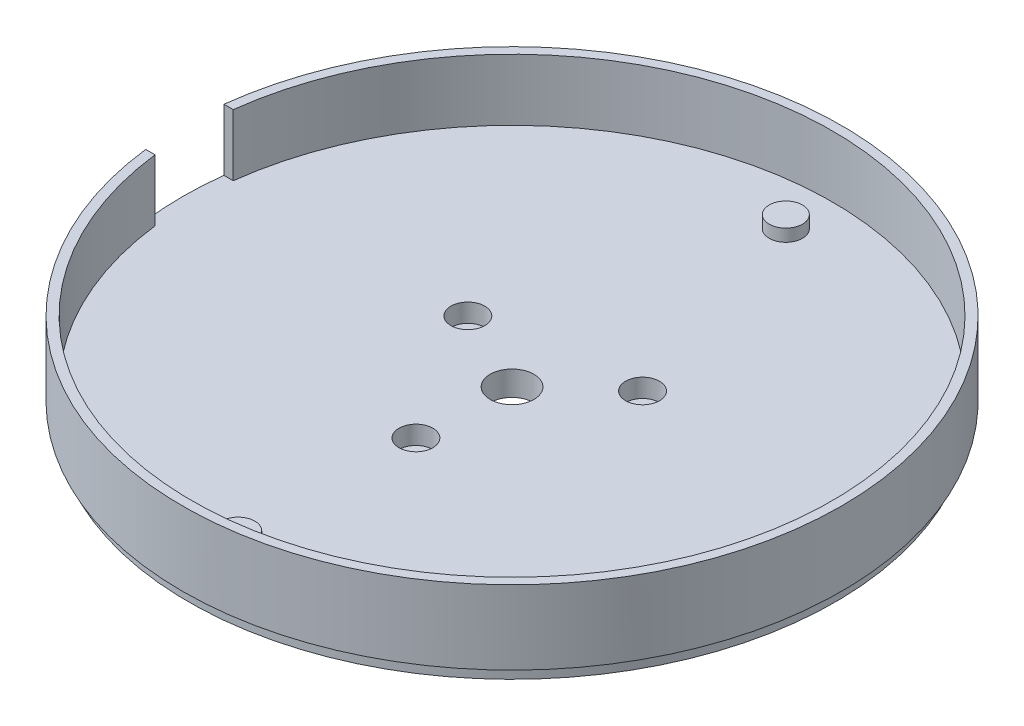
ISO-10303-21;
HEADER;
FILE_DESCRIPTION(('STEP AP214'),'2;1');
FILE_NAME('part.step','',(''),(''),'','','');
FILE_SCHEMA(('AUTOMOTIVE_DESIGN { 1 0 10303 214 1 1 1 1 }'));
ENDSEC;
DATA;
#1=APPLICATION_CONTEXT('core data for automotive mechanical design processes');
#2=APPLICATION_PROTOCOL_DEFINITION('international standard','automotive_design',2000,#1);
#3=PRODUCT_CONTEXT('',#1,'mechanical');
#4=PRODUCT('Part','Part','',(#3));
#5=PRODUCT_RELATED_PRODUCT_CATEGORY('part','',(#4));
#6=PRODUCT_DEFINITION_FORMATION('','',#4);
#7=PRODUCT_DEFINITION_CONTEXT('part definition',#1,'design');
#8=PRODUCT_DEFINITION('design','',#6,#7);
#9=PRODUCT_DEFINITION_SHAPE('','',#8);
#10=(LENGTH_UNIT() NAMED_UNIT(*) SI_UNIT(.MILLI.,.METRE.));
#11=(NAMED_UNIT(*) PLANE_ANGLE_UNIT() SI_UNIT($,.RADIAN.));
#12=(NAMED_UNIT(*) SI_UNIT($,.STERADIAN.) SOLID_ANGLE_UNIT());
#13=UNCERTAINTY_MEASURE_WITH_UNIT(LENGTH_MEASURE(1.E-05),#10,'distance_accuracy_value','');
#14=(GEOMETRIC_REPRESENTATION_CONTEXT(3) GLOBAL_UNCERTAINTY_ASSIGNED_CONTEXT((#13)) GLOBAL_UNIT_ASSIGNED_CONTEXT((#10,
#11,#12)) REPRESENTATION_CONTEXT('',''));
#15=CARTESIAN_POINT('',(0.,0.,0.));
#16=DIRECTION('',(0.,0.,1.));
#17=DIRECTION('',(1.,0.,0.));
#18=AXIS2_PLACEMENT_3D('',#15,#16,#17);
#19=CARTESIAN_POINT('',(0.,2.,0.));
#20=DIRECTION('',(0.,-1.,0.));
#21=DIRECTION('',(0.,0.,-1.));
#22=AXIS2_PLACEMENT_3D('',#19,#20,#21);
#23=CYLINDRICAL_SURFACE('',#22,53.5);
#24=CARTESIAN_POINT('',(0.,0.,0.));
#25=DIRECTION('',(0.,1.,0.));
#26=DIRECTION('',(0.,0.,1.));
#27=AXIS2_PLACEMENT_3D('',#24,#25,#26);
#28=CIRCLE('',#27,53.5);
#29=CARTESIAN_POINT('',(0.,0.,53.5));
#30=VERTEX_POINT('',#29);
#31=EDGE_CURVE('E113',#30,#30,#28,.T.);
#32=ORIENTED_EDGE('',*,*,#31,.T.);
#33=EDGE_LOOP('',(#32));
#34=FACE_BOUND('',#33,.T.);
#35=DIRECTION('',(0.,-1.,0.));
#36=VECTOR('',#35,1.);
#37=CARTESIAN_POINT('',(-53.1218175517367,2.,-6.35));
#38=LINE('',#37,#36);
#39=CARTESIAN_POINT('',(-53.1218175517367,12.,-6.35));
#40=VERTEX_POINT('',#39);
#41=CARTESIAN_POINT('',(-53.1218175517367,2.,-6.35));
#42=VERTEX_POINT('',#41);
#43=EDGE_CURVE('E93',#40,#42,#38,.T.);
#44=ORIENTED_EDGE('',*,*,#43,.F.);
#45=CARTESIAN_POINT('',(0.,12.,0.));
#46=DIRECTION('',(0.,1.,0.));
#47=DIRECTION('',(0.,0.,1.));
#48=AXIS2_PLACEMENT_3D('',#45,#46,#47);
#49=CIRCLE('',#48,53.5);
#50=CARTESIAN_POINT('',(-53.1218175517367,12.,6.35));
#51=VERTEX_POINT('',#50);
#52=EDGE_CURVE('E89',#51,#40,#49,.T.);
#53=ORIENTED_EDGE('',*,*,#52,.F.);
#54=DIRECTION('',(0.,-1.,0.));
#55=VECTOR('',#54,1.);
#56=CARTESIAN_POINT('',(-53.1218175517367,2.,6.35));
#57=LINE('',#56,#55);
#58=CARTESIAN_POINT('',(-53.1218175517367,2.,6.35));
#59=VERTEX_POINT('',#58);
#60=EDGE_CURVE('E97',#51,#59,#57,.T.);
#61=ORIENTED_EDGE('',*,*,#60,.T.);
#62=CARTESIAN_POINT('',(0.,2.,0.));
#63=DIRECTION('',(0.,1.,0.));
#64=DIRECTION('',(0.,0.,1.));
#65=AXIS2_PLACEMENT_3D('',#62,#63,#64);
#66=CIRCLE('',#65,53.5);
#67=EDGE_CURVE('E53',#42,#59,#66,.T.);
#68=ORIENTED_EDGE('',*,*,#67,.F.);
#69=EDGE_LOOP('',(#44,#53,#61,#68));
#70=FACE_BOUND('',#69,.T.);
#71=ADVANCED_FACE('F33',(#34,#70),#23,.T.);
#72=CARTESIAN_POINT('',(0.,12.,0.));
#73=DIRECTION('',(0.,1.,0.));
#74=DIRECTION('',(0.,0.,1.));
#75=AXIS2_PLACEMENT_3D('',#72,#73,#74);
#76=PLANE('',#75);
#77=ORIENTED_EDGE('',*,*,#52,.T.);
#78=DIRECTION('',(-1.,0.,0.));
#79=VECTOR('',#78,1.);
#80=CARTESIAN_POINT('',(0.,12.,-6.34999999999999));
#81=LINE('',#80,#79);
#82=CARTESIAN_POINT('',(-51.6108273524074,12.,-6.35));
#83=VERTEX_POINT('',#82);
#84=EDGE_CURVE('E75',#83,#40,#81,.T.);
#85=ORIENTED_EDGE('',*,*,#84,.F.);
#86=CARTESIAN_POINT('',(0.,12.,0.));
#87=DIRECTION('',(0.,1.,0.));
#88=DIRECTION('',(0.,0.,1.));
#89=AXIS2_PLACEMENT_3D('',#86,#87,#88);
#90=CIRCLE('',#89,52.);
#91=CARTESIAN_POINT('',(-51.6108273524074,12.,6.35));
#92=VERTEX_POINT('',#91);
#93=EDGE_CURVE('E87',#92,#83,#90,.T.);
#94=ORIENTED_EDGE('',*,*,#93,.F.);
#95=DIRECTION('',(-1.,0.,0.));
#96=VECTOR('',#95,1.);
#97=CARTESIAN_POINT('',(0.,12.,6.35000000000001));
#98=LINE('',#97,#96);
#99=EDGE_CURVE('E122',#92,#51,#98,.T.);
#100=ORIENTED_EDGE('',*,*,#99,.T.);
#101=EDGE_LOOP('',(#77,#85,#94,#100));
#102=FACE_BOUND('',#101,.T.);
#103=ADVANCED_FACE('F85',(#102),#76,.T.);
#104=CARTESIAN_POINT('',(0.,12.,0.));
#105=DIRECTION('',(0.,-1.,0.));
#106=DIRECTION('',(0.,0.,-1.));
#107=AXIS2_PLACEMENT_3D('',#104,#105,#106);
#108=CYLINDRICAL_SURFACE('',#107,52.);
#109=ORIENTED_EDGE('',*,*,#93,.T.);
#110=DIRECTION('',(0.,-1.,0.));
#111=VECTOR('',#110,1.);
#112=CARTESIAN_POINT('',(-51.6108273524074,12.,-6.35));
#113=LINE('',#112,#111);
#114=CARTESIAN_POINT('',(-51.6108273524074,2.,-6.35));
#115=VERTEX_POINT('',#114);
#116=EDGE_CURVE('E36',#83,#115,#113,.T.);
#117=ORIENTED_EDGE('',*,*,#116,.T.);
#118=CARTESIAN_POINT('',(0.,2.,0.));
#119=DIRECTION('',(0.,1.,0.));
#120=DIRECTION('',(0.,0.,1.));
#121=AXIS2_PLACEMENT_3D('',#118,#119,#120);
#122=CIRCLE('',#121,52.);
#123=CARTESIAN_POINT('',(-51.6108273524074,2.,6.35));
#124=VERTEX_POINT('',#123);
#125=EDGE_CURVE('E118',#115,#124,#122,.F.);
#126=ORIENTED_EDGE('',*,*,#125,.T.);
#127=DIRECTION('',(0.,-1.,0.));
#128=VECTOR('',#127,1.);
#129=CARTESIAN_POINT('',(-51.6108273524074,12.,6.35));
#130=LINE('',#129,#128);
#131=EDGE_CURVE('E81',#92,#124,#130,.T.);
#132=ORIENTED_EDGE('',*,*,#131,.F.);
#133=EDGE_LOOP('',(#109,#117,#126,#132));
#134=FACE_BOUND('',#133,.T.);
#135=ADVANCED_FACE('F92',(#134),#108,.F.);
#136=CARTESIAN_POINT('',(0.,2.,0.));
#137=DIRECTION('',(0.,1.,0.));
#138=DIRECTION('',(0.,0.,1.));
#139=AXIS2_PLACEMENT_3D('',#136,#137,#138);
#140=PLANE('',#139);
#141=CARTESIAN_POINT('',(-13.5680105059994,2.,-6.39602149066831));
#142=DIRECTION('',(0.,1.,0.));
#143=DIRECTION('',(0.,0.,1.));
#144=AXIS2_PLACEMENT_3D('',#141,#142,#143);
#145=CIRCLE('',#144,2.75);
#146=CARTESIAN_POINT('',(-13.5680105059994,2.,-3.64602149066831));
#147=VERTEX_POINT('',#146);
#148=EDGE_CURVE('E151',#147,#147,#145,.T.);
#149=ORIENTED_EDGE('',*,*,#148,.F.);
#150=EDGE_LOOP('',(#149));
#151=FACE_BOUND('',#150,.T.);
#152=CARTESIAN_POINT('',(-0.616107979777022,2.,14.9873416908155));
#153=DIRECTION('',(0.,1.,0.));
#154=DIRECTION('',(0.,0.,1.));
#155=AXIS2_PLACEMENT_3D('',#152,#153,#154);
#156=CIRCLE('',#155,2.75);
#157=CARTESIAN_POINT('',(-0.616107979777022,2.,17.7373416908155));
#158=VERTEX_POINT('',#157);
#159=EDGE_CURVE('E148',#158,#158,#156,.T.);
#160=ORIENTED_EDGE('',*,*,#159,.F.);
#161=EDGE_LOOP('',(#160));
#162=FACE_BOUND('',#161,.T.);
#163=CARTESIAN_POINT('',(11.1690050399988,2.,-10.0126583091845));
#164=DIRECTION('',(0.,1.,0.));
#165=DIRECTION('',(0.,0.,1.));
#166=AXIS2_PLACEMENT_3D('',#163,#164,#165);
#167=CIRCLE('',#166,2.75);
#168=CARTESIAN_POINT('',(11.1690050399988,2.,-7.26265830918455));
#169=VERTEX_POINT('',#168);
#170=EDGE_CURVE('E141',#169,#169,#167,.T.);
#171=ORIENTED_EDGE('',*,*,#170,.F.);
#172=EDGE_LOOP('',(#171));
#173=FACE_BOUND('',#172,.T.);
#174=CARTESIAN_POINT('',(0.,2.,0.));
#175=DIRECTION('',(0.,1.,0.));
#176=DIRECTION('',(0.,0.,1.));
#177=AXIS2_PLACEMENT_3D('',#174,#175,#176);
#178=CIRCLE('',#177,3.55);
#179=CARTESIAN_POINT('',(0.,2.,3.55));
#180=VERTEX_POINT('',#179);
#181=EDGE_CURVE('E95',#180,#180,#178,.T.);
#182=ORIENTED_EDGE('',*,*,#181,.F.);
#183=EDGE_LOOP('',(#182));
#184=FACE_BOUND('',#183,.T.);
#185=ORIENTED_EDGE('',*,*,#125,.F.);
#186=DIRECTION('',(-1.,0.,0.));
#187=VECTOR('',#186,1.);
#188=CARTESIAN_POINT('',(0.,2.,-6.34999999999999));
#189=LINE('',#188,#187);
#190=EDGE_CURVE('E77',#115,#42,#189,.T.);
#191=ORIENTED_EDGE('',*,*,#190,.T.);
#192=ORIENTED_EDGE('',*,*,#67,.T.);
#193=DIRECTION('',(-1.,0.,0.));
#194=VECTOR('',#193,1.);
#195=CARTESIAN_POINT('',(0.,2.,6.35000000000001));
#196=LINE('',#195,#194);
#197=EDGE_CURVE('E48',#124,#59,#196,.T.);
#198=ORIENTED_EDGE('',*,*,#197,.F.);
#199=EDGE_LOOP('',(#185,#191,#192,#198));
#200=FACE_BOUND('',#199,.T.);
#201=CARTESIAN_POINT('',(0.,2.,44.45));
#202=DIRECTION('',(0.,1.,0.));
#203=DIRECTION('',(0.,0.,1.));
#204=AXIS2_PLACEMENT_3D('',#201,#202,#203);
#205=CIRCLE('',#204,2.7);
#206=CARTESIAN_POINT('',(0.,2.,47.15));
#207=VERTEX_POINT('',#206);
#208=EDGE_CURVE('E107',#207,#207,#205,.T.);
#209=ORIENTED_EDGE('',*,*,#208,.F.);
#210=EDGE_LOOP('',(#209));
#211=FACE_BOUND('',#210,.T.);
#212=CARTESIAN_POINT('',(0.,2.,-44.45));
#213=DIRECTION('',(0.,1.,0.));
#214=DIRECTION('',(0.,0.,1.));
#215=AXIS2_PLACEMENT_3D('',#212,#213,#214);
#216=CIRCLE('',#215,2.7);
#217=CARTESIAN_POINT('',(0.,2.,-41.75));
#218=VERTEX_POINT('',#217);
#219=EDGE_CURVE('E103',#218,#218,#216,.T.);
#220=ORIENTED_EDGE('',*,*,#219,.F.);
#221=EDGE_LOOP('',(#220));
#222=FACE_BOUND('',#221,.T.);
#223=ADVANCED_FACE('F123',(#151,#162,#173,#184,#200,#211,#222),#140,.T.);
#224=CARTESIAN_POINT('',(0.,0.,0.));
#225=DIRECTION('',(0.,1.,0.));
#226=DIRECTION('',(0.,0.,1.));
#227=AXIS2_PLACEMENT_3D('',#224,#225,#226);
#228=PLANE('',#227);
#229=CARTESIAN_POINT('',(0.,0.,0.));
#230=DIRECTION('',(0.,-1.,0.));
#231=DIRECTION('',(0.,0.,-1.));
#232=AXIS2_PLACEMENT_3D('',#229,#230,#231);
#233=CIRCLE('',#232,52.5);
#234=CARTESIAN_POINT('',(0.,0.,-52.5));
#235=VERTEX_POINT('',#234);
#236=EDGE_CURVE('E11',#235,#235,#233,.T.);
#237=ORIENTED_EDGE('',*,*,#236,.F.);
#238=EDGE_LOOP('',(#237));
#239=FACE_BOUND('',#238,.T.);
#240=ORIENTED_EDGE('',*,*,#31,.F.);
#241=EDGE_LOOP('',(#240));
#242=FACE_BOUND('',#241,.T.);
#243=ADVANCED_FACE('F200',(#239,#242),#228,.F.);
#244=CARTESIAN_POINT('',(0.,4.,44.45));
#245=DIRECTION('',(0.,-1.,0.));
#246=DIRECTION('',(0.,0.,-1.));
#247=AXIS2_PLACEMENT_3D('',#244,#245,#246);
#248=CYLINDRICAL_SURFACE('',#247,2.7);
#249=CARTESIAN_POINT('',(0.,4.,44.45));
#250=DIRECTION('',(0.,1.,0.));
#251=DIRECTION('',(0.,0.,1.));
#252=AXIS2_PLACEMENT_3D('',#249,#250,#251);
#253=CIRCLE('',#252,2.7);
#254=CARTESIAN_POINT('',(0.,4.,47.15));
#255=VERTEX_POINT('',#254);
#256=EDGE_CURVE('E110',#255,#255,#253,.T.);
#257=ORIENTED_EDGE('',*,*,#256,.F.);
#258=EDGE_LOOP('',(#257));
#259=FACE_BOUND('',#258,.T.);
#260=ORIENTED_EDGE('',*,*,#208,.T.);
#261=EDGE_LOOP('',(#260));
#262=FACE_BOUND('',#261,.T.);
#263=ADVANCED_FACE('F236',(#259,#262),#248,.T.);
#264=CARTESIAN_POINT('',(0.,4.,44.45));
#265=DIRECTION('',(0.,1.,0.));
#266=DIRECTION('',(0.,0.,1.));
#267=AXIS2_PLACEMENT_3D('',#264,#265,#266);
#268=PLANE('',#267);
#269=ORIENTED_EDGE('',*,*,#256,.T.);
#270=EDGE_LOOP('',(#269));
#271=FACE_BOUND('',#270,.T.);
#272=ADVANCED_FACE('F241',(#271),#268,.T.);
#273=CARTESIAN_POINT('',(0.,4.,-44.45));
#274=DIRECTION('',(0.,-1.,0.));
#275=DIRECTION('',(0.,0.,-1.));
#276=AXIS2_PLACEMENT_3D('',#273,#274,#275);
#277=CYLINDRICAL_SURFACE('',#276,2.7);
#278=CARTESIAN_POINT('',(0.,4.,-44.45));
#279=DIRECTION('',(0.,1.,0.));
#280=DIRECTION('',(0.,0.,1.));
#281=AXIS2_PLACEMENT_3D('',#278,#279,#280);
#282=CIRCLE('',#281,2.7);
#283=CARTESIAN_POINT('',(0.,4.,-41.75));
#284=VERTEX_POINT('',#283);
#285=EDGE_CURVE('E104',#284,#284,#282,.T.);
#286=ORIENTED_EDGE('',*,*,#285,.F.);
#287=EDGE_LOOP('',(#286));
#288=FACE_BOUND('',#287,.T.);
#289=ORIENTED_EDGE('',*,*,#219,.T.);
#290=EDGE_LOOP('',(#289));
#291=FACE_BOUND('',#290,.T.);
#292=ADVANCED_FACE('F248',(#288,#291),#277,.T.);
#293=CARTESIAN_POINT('',(0.,4.,-44.45));
#294=DIRECTION('',(0.,1.,0.));
#295=DIRECTION('',(0.,0.,1.));
#296=AXIS2_PLACEMENT_3D('',#293,#294,#295);
#297=PLANE('',#296);
#298=ORIENTED_EDGE('',*,*,#285,.T.);
#299=EDGE_LOOP('',(#298));
#300=FACE_BOUND('',#299,.T.);
#301=ADVANCED_FACE('F211',(#300),#297,.T.);
#302=CARTESIAN_POINT('',(0.,0.,0.));
#303=DIRECTION('',(0.,1.,0.));
#304=DIRECTION('',(0.,0.,1.));
#305=AXIS2_PLACEMENT_3D('',#302,#303,#304);
#306=CYLINDRICAL_SURFACE('',#305,3.55);
#307=ORIENTED_EDGE('',*,*,#181,.T.);
#308=EDGE_LOOP('',(#307));
#309=FACE_BOUND('',#308,.T.);
#310=CARTESIAN_POINT('',(0.,-2.,0.));
#311=DIRECTION('',(0.,-1.,0.));
#312=DIRECTION('',(0.,0.,-1.));
#313=AXIS2_PLACEMENT_3D('',#310,#311,#312);
#314=CIRCLE('',#313,3.55);
#315=CARTESIAN_POINT('',(0.,-2.,-3.55));
#316=VERTEX_POINT('',#315);
#317=EDGE_CURVE('E134',#316,#316,#314,.T.);
#318=ORIENTED_EDGE('',*,*,#317,.T.);
#319=EDGE_LOOP('',(#318));
#320=FACE_BOUND('',#319,.T.);
#321=ADVANCED_FACE('F208',(#309,#320),#306,.F.);
#322=CARTESIAN_POINT('',(0.,70.057883938542,-6.34999999999999));
#323=DIRECTION('',(0.,0.,1.));
#324=DIRECTION('',(1.,0.,0.));
#325=AXIS2_PLACEMENT_3D('',#322,#323,#324);
#326=PLANE('',#325);
#327=ORIENTED_EDGE('',*,*,#43,.T.);
#328=ORIENTED_EDGE('',*,*,#190,.F.);
#329=ORIENTED_EDGE('',*,*,#116,.F.);
#330=ORIENTED_EDGE('',*,*,#84,.T.);
#331=EDGE_LOOP('',(#327,#328,#329,#330));
#332=FACE_BOUND('',#331,.T.);
#333=ADVANCED_FACE('F74',(#332),#326,.T.);
#334=CARTESIAN_POINT('',(0.,70.057883938542,6.35000000000001));
#335=DIRECTION('',(0.,0.,1.));
#336=DIRECTION('',(1.,0.,0.));
#337=AXIS2_PLACEMENT_3D('',#334,#335,#336);
#338=PLANE('',#337);
#339=ORIENTED_EDGE('',*,*,#99,.F.);
#340=ORIENTED_EDGE('',*,*,#131,.T.);
#341=ORIENTED_EDGE('',*,*,#197,.T.);
#342=ORIENTED_EDGE('',*,*,#60,.F.);
#343=EDGE_LOOP('',(#339,#340,#341,#342));
#344=FACE_BOUND('',#343,.T.);
#345=ADVANCED_FACE('F120',(#344),#338,.F.);
#346=CARTESIAN_POINT('',(0.,-2.,0.));
#347=DIRECTION('',(0.,-1.,0.));
#348=DIRECTION('',(0.,0.,-1.));
#349=AXIS2_PLACEMENT_3D('',#346,#347,#348);
#350=PLANE('',#349);
#351=CARTESIAN_POINT('',(-13.5680105059994,-2.,-6.39602149066831));
#352=DIRECTION('',(0.,1.,0.));
#353=DIRECTION('',(0.,0.,1.));
#354=AXIS2_PLACEMENT_3D('',#351,#352,#353);
#355=CIRCLE('',#354,1.5);
#356=CARTESIAN_POINT('',(-13.5680105059994,-2.,-4.89602149066831));
#357=VERTEX_POINT('',#356);
#358=EDGE_CURVE('E142',#357,#357,#355,.T.);
#359=ORIENTED_EDGE('',*,*,#358,.T.);
#360=EDGE_LOOP('',(#359));
#361=FACE_BOUND('',#360,.T.);
#362=CARTESIAN_POINT('',(-0.616107979777022,-2.,14.9873416908155));
#363=DIRECTION('',(0.,1.,0.));
#364=DIRECTION('',(0.,0.,1.));
#365=AXIS2_PLACEMENT_3D('',#362,#363,#364);
#366=CIRCLE('',#365,1.5);
#367=CARTESIAN_POINT('',(-0.616107979777022,-2.,16.4873416908155));
#368=VERTEX_POINT('',#367);
#369=EDGE_CURVE('E162',#368,#368,#366,.T.);
#370=ORIENTED_EDGE('',*,*,#369,.T.);
#371=EDGE_LOOP('',(#370));
#372=FACE_BOUND('',#371,.T.);
#373=CARTESIAN_POINT('',(11.1690050399988,-2.,-10.0126583091845));
#374=DIRECTION('',(0.,1.,0.));
#375=DIRECTION('',(0.,0.,1.));
#376=AXIS2_PLACEMENT_3D('',#373,#374,#375);
#377=CIRCLE('',#376,1.5);
#378=CARTESIAN_POINT('',(11.1690050399988,-2.,-8.51265830918454));
#379=VERTEX_POINT('',#378);
#380=EDGE_CURVE('E156',#379,#379,#377,.T.);
#381=ORIENTED_EDGE('',*,*,#380,.T.);
#382=EDGE_LOOP('',(#381));
#383=FACE_BOUND('',#382,.T.);
#384=CARTESIAN_POINT('',(0.,-2.,0.));
#385=DIRECTION('',(0.,-1.,0.));
#386=DIRECTION('',(0.,0.,-1.));
#387=AXIS2_PLACEMENT_3D('',#384,#385,#386);
#388=CIRCLE('',#387,52.5);
#389=CARTESIAN_POINT('',(0.,-2.,-52.5));
#390=VERTEX_POINT('',#389);
#391=EDGE_CURVE('E125',#390,#390,#388,.T.);
#392=ORIENTED_EDGE('',*,*,#391,.T.);
#393=EDGE_LOOP('',(#392));
#394=FACE_BOUND('',#393,.T.);
#395=ORIENTED_EDGE('',*,*,#317,.F.);
#396=EDGE_LOOP('',(#395));
#397=FACE_BOUND('',#396,.T.);
#398=ADVANCED_FACE('F174',(#361,#372,#383,#394,#397),#350,.T.);
#399=CARTESIAN_POINT('',(0.,-2.,0.));
#400=DIRECTION('',(0.,1.,0.));
#401=DIRECTION('',(0.,0.,1.));
#402=AXIS2_PLACEMENT_3D('',#399,#400,#401);
#403=CYLINDRICAL_SURFACE('',#402,52.5);
#404=ORIENTED_EDGE('',*,*,#391,.F.);
#405=EDGE_LOOP('',(#404));
#406=FACE_BOUND('',#405,.T.);
#407=ORIENTED_EDGE('',*,*,#236,.T.);
#408=EDGE_LOOP('',(#407));
#409=FACE_BOUND('',#408,.T.);
#410=ADVANCED_FACE('F216',(#406,#409),#403,.T.);
#411=CARTESIAN_POINT('',(11.1690050399988,-1.,-10.0126583091845));
#412=DIRECTION('',(0.,1.,0.));
#413=DIRECTION('',(0.,0.,1.));
#414=AXIS2_PLACEMENT_3D('',#411,#412,#413);
#415=CYLINDRICAL_SURFACE('',#414,2.75);
#416=CARTESIAN_POINT('',(11.1690050399988,-1.,-10.0126583091845));
#417=DIRECTION('',(0.,1.,0.));
#418=DIRECTION('',(0.,0.,1.));
#419=AXIS2_PLACEMENT_3D('',#416,#417,#418);
#420=CIRCLE('',#419,2.75);
#421=CARTESIAN_POINT('',(11.1690050399988,-1.,-7.26265830918455));
#422=VERTEX_POINT('',#421);
#423=EDGE_CURVE('E138',#422,#422,#420,.T.);
#424=ORIENTED_EDGE('',*,*,#423,.F.);
#425=EDGE_LOOP('',(#424));
#426=FACE_BOUND('',#425,.T.);
#427=ORIENTED_EDGE('',*,*,#170,.T.);
#428=EDGE_LOOP('',(#427));
#429=FACE_BOUND('',#428,.T.);
#430=ADVANCED_FACE('F222',(#426,#429),#415,.F.);
#431=CARTESIAN_POINT('',(11.1690050399988,-1.,-10.0126583091845));
#432=DIRECTION('',(0.,1.,0.));
#433=DIRECTION('',(0.,0.,1.));
#434=AXIS2_PLACEMENT_3D('',#431,#432,#433);
#435=PLANE('',#434);
#436=CARTESIAN_POINT('',(11.1690050399988,-1.,-10.0126583091845));
#437=DIRECTION('',(0.,1.,0.));
#438=DIRECTION('',(0.,0.,1.));
#439=AXIS2_PLACEMENT_3D('',#436,#437,#438);
#440=CIRCLE('',#439,1.5);
#441=CARTESIAN_POINT('',(11.1690050399988,-1.,-8.51265830918454));
#442=VERTEX_POINT('',#441);
#443=EDGE_CURVE('E159',#442,#442,#440,.T.);
#444=ORIENTED_EDGE('',*,*,#443,.F.);
#445=EDGE_LOOP('',(#444));
#446=FACE_BOUND('',#445,.T.);
#447=ORIENTED_EDGE('',*,*,#423,.T.);
#448=EDGE_LOOP('',(#447));
#449=FACE_BOUND('',#448,.T.);
#450=ADVANCED_FACE('F302',(#446,#449),#435,.T.);
#451=CARTESIAN_POINT('',(-0.616107979777022,-1.,14.9873416908155));
#452=DIRECTION('',(0.,1.,0.));
#453=DIRECTION('',(0.,0.,1.));
#454=AXIS2_PLACEMENT_3D('',#451,#452,#453);
#455=CYLINDRICAL_SURFACE('',#454,2.75);
#456=CARTESIAN_POINT('',(-0.616107979777022,-1.,14.9873416908155));
#457=DIRECTION('',(0.,1.,0.));
#458=DIRECTION('',(0.,0.,1.));
#459=AXIS2_PLACEMENT_3D('',#456,#457,#458);
#460=CIRCLE('',#459,2.75);
#461=CARTESIAN_POINT('',(-0.616107979777022,-1.,17.7373416908155));
#462=VERTEX_POINT('',#461);
#463=EDGE_CURVE('E145',#462,#462,#460,.T.);
#464=ORIENTED_EDGE('',*,*,#463,.F.);
#465=EDGE_LOOP('',(#464));
#466=FACE_BOUND('',#465,.T.);
#467=ORIENTED_EDGE('',*,*,#159,.T.);
#468=EDGE_LOOP('',(#467));
#469=FACE_BOUND('',#468,.T.);
#470=ADVANCED_FACE('F310',(#466,#469),#455,.F.);
#471=CARTESIAN_POINT('',(-0.616107979777022,-1.,14.9873416908155));
#472=DIRECTION('',(0.,1.,0.));
#473=DIRECTION('',(0.,0.,1.));
#474=AXIS2_PLACEMENT_3D('',#471,#472,#473);
#475=PLANE('',#474);
#476=CARTESIAN_POINT('',(-0.616107979777022,-1.,14.9873416908155));
#477=DIRECTION('',(0.,1.,0.));
#478=DIRECTION('',(0.,0.,1.));
#479=AXIS2_PLACEMENT_3D('',#476,#477,#478);
#480=CIRCLE('',#479,1.5);
#481=CARTESIAN_POINT('',(-0.616107979777022,-1.,16.4873416908155));
#482=VERTEX_POINT('',#481);
#483=EDGE_CURVE('E165',#482,#482,#480,.T.);
#484=ORIENTED_EDGE('',*,*,#483,.F.);
#485=EDGE_LOOP('',(#484));
#486=FACE_BOUND('',#485,.T.);
#487=ORIENTED_EDGE('',*,*,#463,.T.);
#488=EDGE_LOOP('',(#487));
#489=FACE_BOUND('',#488,.T.);
#490=ADVANCED_FACE('F194',(#486,#489),#475,.T.);
#491=CARTESIAN_POINT('',(-13.5680105059994,-1.,-6.39602149066831));
#492=DIRECTION('',(0.,1.,0.));
#493=DIRECTION('',(0.,0.,1.));
#494=AXIS2_PLACEMENT_3D('',#491,#492,#493);
#495=CYLINDRICAL_SURFACE('',#494,2.75);
#496=CARTESIAN_POINT('',(-13.5680105059994,-1.,-6.39602149066831));
#497=DIRECTION('',(0.,1.,0.));
#498=DIRECTION('',(0.,0.,1.));
#499=AXIS2_PLACEMENT_3D('',#496,#497,#498);
#500=CIRCLE('',#499,2.75);
#501=CARTESIAN_POINT('',(-13.5680105059994,-1.,-3.64602149066831));
#502=VERTEX_POINT('',#501);
#503=EDGE_CURVE('E137',#502,#502,#500,.T.);
#504=ORIENTED_EDGE('',*,*,#503,.F.);
#505=EDGE_LOOP('',(#504));
#506=FACE_BOUND('',#505,.T.);
#507=ORIENTED_EDGE('',*,*,#148,.T.);
#508=EDGE_LOOP('',(#507));
#509=FACE_BOUND('',#508,.T.);
#510=ADVANCED_FACE('F188',(#506,#509),#495,.F.);
#511=CARTESIAN_POINT('',(-13.5680105059994,-1.,-6.39602149066831));
#512=DIRECTION('',(0.,1.,0.));
#513=DIRECTION('',(0.,0.,1.));
#514=AXIS2_PLACEMENT_3D('',#511,#512,#513);
#515=PLANE('',#514);
#516=CARTESIAN_POINT('',(-13.5680105059994,-1.,-6.39602149066831));
#517=DIRECTION('',(0.,1.,0.));
#518=DIRECTION('',(0.,0.,1.));
#519=AXIS2_PLACEMENT_3D('',#516,#517,#518);
#520=CIRCLE('',#519,1.5);
#521=CARTESIAN_POINT('',(-13.5680105059994,-1.,-4.89602149066831));
#522=VERTEX_POINT('',#521);
#523=EDGE_CURVE('E168',#522,#522,#520,.T.);
#524=ORIENTED_EDGE('',*,*,#523,.F.);
#525=EDGE_LOOP('',(#524));
#526=FACE_BOUND('',#525,.T.);
#527=ORIENTED_EDGE('',*,*,#503,.T.);
#528=EDGE_LOOP('',(#527));
#529=FACE_BOUND('',#528,.T.);
#530=ADVANCED_FACE('F184',(#526,#529),#515,.T.);
#531=CARTESIAN_POINT('',(11.1690050399988,-2.,-10.0126583091845));
#532=DIRECTION('',(0.,1.,0.));
#533=DIRECTION('',(0.,0.,1.));
#534=AXIS2_PLACEMENT_3D('',#531,#532,#533);
#535=CYLINDRICAL_SURFACE('',#534,1.5);
#536=ORIENTED_EDGE('',*,*,#380,.F.);
#537=EDGE_LOOP('',(#536));
#538=FACE_BOUND('',#537,.T.);
#539=ORIENTED_EDGE('',*,*,#443,.T.);
#540=EDGE_LOOP('',(#539));
#541=FACE_BOUND('',#540,.T.);
#542=ADVANCED_FACE('F187',(#538,#541),#535,.F.);
#543=CARTESIAN_POINT('',(-0.616107979777022,-2.,14.9873416908155));
#544=DIRECTION('',(0.,1.,0.));
#545=DIRECTION('',(0.,0.,1.));
#546=AXIS2_PLACEMENT_3D('',#543,#544,#545);
#547=CYLINDRICAL_SURFACE('',#546,1.5);
#548=ORIENTED_EDGE('',*,*,#369,.F.);
#549=EDGE_LOOP('',(#548));
#550=FACE_BOUND('',#549,.T.);
#551=ORIENTED_EDGE('',*,*,#483,.T.);
#552=EDGE_LOOP('',(#551));
#553=FACE_BOUND('',#552,.T.);
#554=ADVANCED_FACE('F180',(#550,#553),#547,.F.);
#555=CARTESIAN_POINT('',(-13.5680105059994,-2.,-6.39602149066831));
#556=DIRECTION('',(0.,1.,0.));
#557=DIRECTION('',(0.,0.,1.));
#558=AXIS2_PLACEMENT_3D('',#555,#556,#557);
#559=CYLINDRICAL_SURFACE('',#558,1.5);
#560=ORIENTED_EDGE('',*,*,#358,.F.);
#561=EDGE_LOOP('',(#560));
#562=FACE_BOUND('',#561,.T.);
#563=ORIENTED_EDGE('',*,*,#523,.T.);
#564=EDGE_LOOP('',(#563));
#565=FACE_BOUND('',#564,.T.);
#566=ADVANCED_FACE('F177',(#562,#565),#559,.F.);
#567=CLOSED_SHELL('',(#71,#103,#135,#223,#243,#263,#272,#292,#301,#321,#333,#345,#398,#410,#430,
#450,#470,#490,#510,#530,#542,#554,#566));
#568=MANIFOLD_SOLID_BREP('B2',#567);
#569=ADVANCED_BREP_SHAPE_REPRESENTATION('',(#18,#568),#14);
#570=SHAPE_DEFINITION_REPRESENTATION(#9,#569);
ENDSEC;
END-ISO-10303-21;
